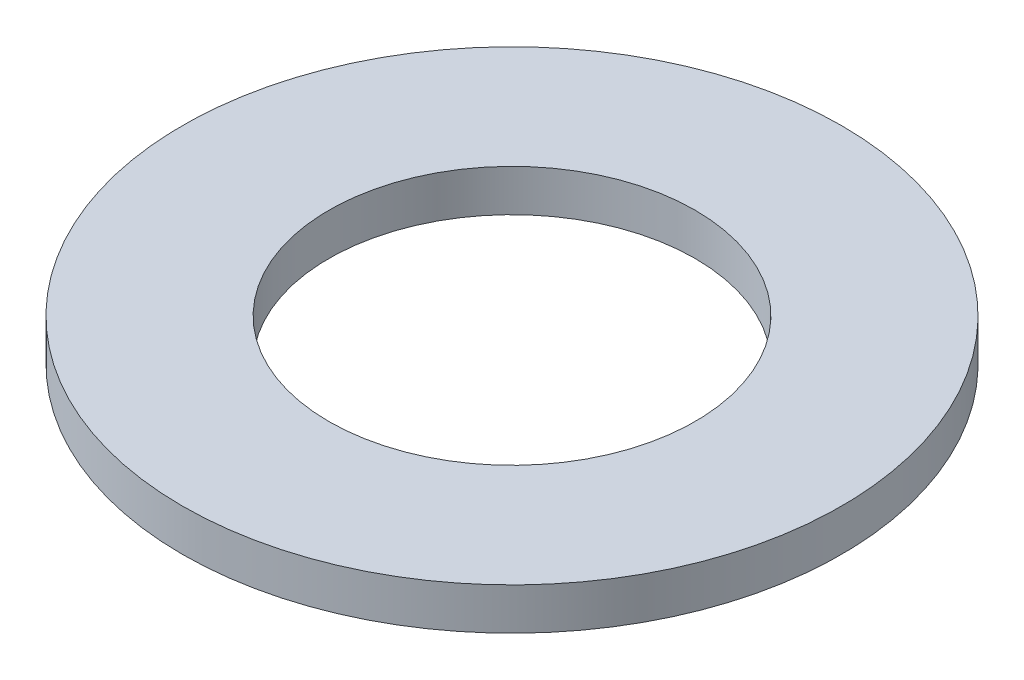
ISO-10303-21;
HEADER;
FILE_DESCRIPTION(('STEP AP214'),'2;1');
FILE_NAME('part.step','',(''),(''),'','','');
FILE_SCHEMA(('AUTOMOTIVE_DESIGN { 1 0 10303 214 1 1 1 1 }'));
ENDSEC;
DATA;
#1=APPLICATION_CONTEXT('core data for automotive mechanical design processes');
#2=APPLICATION_PROTOCOL_DEFINITION('international standard','automotive_design',2000,#1);
#3=PRODUCT_CONTEXT('',#1,'mechanical');
#4=PRODUCT('Part','Part','',(#3));
#5=PRODUCT_RELATED_PRODUCT_CATEGORY('part','',(#4));
#6=PRODUCT_DEFINITION_FORMATION('','',#4);
#7=PRODUCT_DEFINITION_CONTEXT('part definition',#1,'design');
#8=PRODUCT_DEFINITION('design','',#6,#7);
#9=PRODUCT_DEFINITION_SHAPE('','',#8);
#10=(LENGTH_UNIT() NAMED_UNIT(*) SI_UNIT(.MILLI.,.METRE.));
#11=(NAMED_UNIT(*) PLANE_ANGLE_UNIT() SI_UNIT($,.RADIAN.));
#12=(NAMED_UNIT(*) SI_UNIT($,.STERADIAN.) SOLID_ANGLE_UNIT());
#13=UNCERTAINTY_MEASURE_WITH_UNIT(LENGTH_MEASURE(1.E-05),#10,'distance_accuracy_value','');
#14=(GEOMETRIC_REPRESENTATION_CONTEXT(3) GLOBAL_UNCERTAINTY_ASSIGNED_CONTEXT((#13)) GLOBAL_UNIT_ASSIGNED_CONTEXT((#10,
#11,#12)) REPRESENTATION_CONTEXT('',''));
#15=CARTESIAN_POINT('',(0.,0.,0.));
#16=DIRECTION('',(0.,0.,1.));
#17=DIRECTION('',(1.,0.,0.));
#18=AXIS2_PLACEMENT_3D('',#15,#16,#17);
#19=CARTESIAN_POINT('',(0.,0.,0.));
#20=DIRECTION('',(0.,1.,0.));
#21=DIRECTION('',(0.,0.,1.));
#22=AXIS2_PLACEMENT_3D('',#19,#20,#21);
#23=PLANE('',#22);
#24=CARTESIAN_POINT('',(0.,0.,0.));
#25=DIRECTION('',(0.,-1.,0.));
#26=DIRECTION('',(0.,0.,-1.));
#27=AXIS2_PLACEMENT_3D('',#24,#25,#26);
#28=CIRCLE('',#27,2.625);
#29=CARTESIAN_POINT('',(0.,0.,-2.625));
#30=VERTEX_POINT('',#29);
#31=EDGE_CURVE('E26',#30,#30,#28,.F.);
#32=ORIENTED_EDGE('',*,*,#31,.T.);
#33=EDGE_LOOP('',(#32));
#34=FACE_BOUND('',#33,.T.);
#35=CARTESIAN_POINT('',(0.,0.,0.));
#36=DIRECTION('',(0.,-1.,0.));
#37=DIRECTION('',(0.,0.,-1.));
#38=AXIS2_PLACEMENT_3D('',#35,#36,#37);
#39=CIRCLE('',#38,4.725);
#40=CARTESIAN_POINT('',(0.,0.,-4.725));
#41=VERTEX_POINT('',#40);
#42=EDGE_CURVE('E17',#41,#41,#39,.F.);
#43=ORIENTED_EDGE('',*,*,#42,.F.);
#44=EDGE_LOOP('',(#43));
#45=FACE_BOUND('',#44,.T.);
#46=ADVANCED_FACE('F14',(#34,#45),#23,.F.);
#47=CARTESIAN_POINT('',(0.,0.6,0.));
#48=DIRECTION('',(0.,-1.,0.));
#49=DIRECTION('',(0.,0.,-1.));
#50=AXIS2_PLACEMENT_3D('',#47,#48,#49);
#51=CYLINDRICAL_SURFACE('',#50,4.725);
#52=ORIENTED_EDGE('',*,*,#42,.T.);
#53=EDGE_LOOP('',(#52));
#54=FACE_BOUND('',#53,.T.);
#55=CARTESIAN_POINT('',(0.,0.6,0.));
#56=DIRECTION('',(0.,-1.,0.));
#57=DIRECTION('',(0.,0.,-1.));
#58=AXIS2_PLACEMENT_3D('',#55,#56,#57);
#59=CIRCLE('',#58,4.725);
#60=CARTESIAN_POINT('',(0.,0.6,-4.725));
#61=VERTEX_POINT('',#60);
#62=EDGE_CURVE('E21',#61,#61,#59,.F.);
#63=ORIENTED_EDGE('',*,*,#62,.F.);
#64=EDGE_LOOP('',(#63));
#65=FACE_BOUND('',#64,.T.);
#66=ADVANCED_FACE('F34',(#54,#65),#51,.T.);
#67=CARTESIAN_POINT('',(0.,0.6,0.));
#68=DIRECTION('',(0.,-1.,0.));
#69=DIRECTION('',(0.,0.,-1.));
#70=AXIS2_PLACEMENT_3D('',#67,#68,#69);
#71=CYLINDRICAL_SURFACE('',#70,2.625);
#72=CARTESIAN_POINT('',(0.,0.6,0.));
#73=DIRECTION('',(0.,-1.,0.));
#74=DIRECTION('',(0.,0.,-1.));
#75=AXIS2_PLACEMENT_3D('',#72,#73,#74);
#76=CIRCLE('',#75,2.625);
#77=CARTESIAN_POINT('',(0.,0.6,-2.625));
#78=VERTEX_POINT('',#77);
#79=EDGE_CURVE('E10',#78,#78,#76,.T.);
#80=ORIENTED_EDGE('',*,*,#79,.F.);
#81=EDGE_LOOP('',(#80));
#82=FACE_BOUND('',#81,.T.);
#83=ORIENTED_EDGE('',*,*,#31,.F.);
#84=EDGE_LOOP('',(#83));
#85=FACE_BOUND('',#84,.T.);
#86=ADVANCED_FACE('F42',(#82,#85),#71,.F.);
#87=CARTESIAN_POINT('',(0.,0.6,0.));
#88=DIRECTION('',(0.,1.,0.));
#89=DIRECTION('',(0.,0.,1.));
#90=AXIS2_PLACEMENT_3D('',#87,#88,#89);
#91=PLANE('',#90);
#92=ORIENTED_EDGE('',*,*,#79,.T.);
#93=EDGE_LOOP('',(#92));
#94=FACE_BOUND('',#93,.T.);
#95=ORIENTED_EDGE('',*,*,#62,.T.);
#96=EDGE_LOOP('',(#95));
#97=FACE_BOUND('',#96,.T.);
#98=ADVANCED_FACE('F43',(#94,#97),#91,.T.);
#99=CLOSED_SHELL('',(#46,#66,#86,#98));
#100=MANIFOLD_SOLID_BREP('B1',#99);
#101=ADVANCED_BREP_SHAPE_REPRESENTATION('',(#18,#100),#14);
#102=SHAPE_DEFINITION_REPRESENTATION(#9,#101);
ENDSEC;
END-ISO-10303-21;
